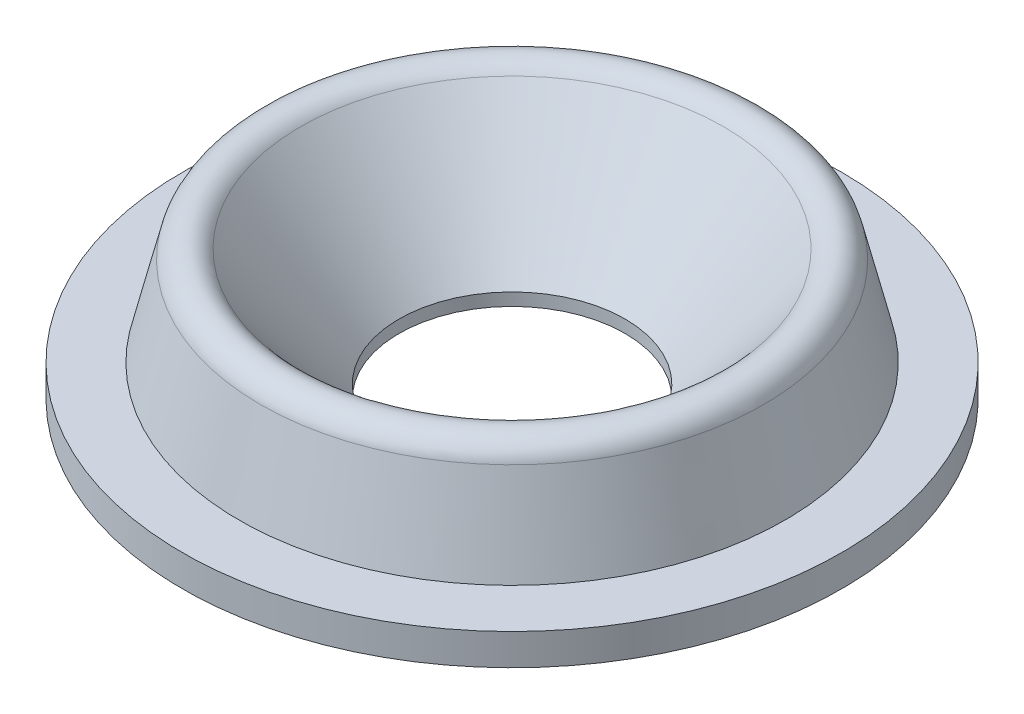
ISO-10303-21;
HEADER;
FILE_DESCRIPTION(('STEP AP214'),'2;1');
FILE_NAME('part.step','',(''),(''),'','','');
FILE_SCHEMA(('AUTOMOTIVE_DESIGN { 1 0 10303 214 1 1 1 1 }'));
ENDSEC;
DATA;
#1=APPLICATION_CONTEXT('core data for automotive mechanical design processes');
#2=APPLICATION_PROTOCOL_DEFINITION('international standard','automotive_design',2000,#1);
#3=PRODUCT_CONTEXT('',#1,'mechanical');
#4=PRODUCT('Part','Part','',(#3));
#5=PRODUCT_RELATED_PRODUCT_CATEGORY('part','',(#4));
#6=PRODUCT_DEFINITION_FORMATION('','',#4);
#7=PRODUCT_DEFINITION_CONTEXT('part definition',#1,'design');
#8=PRODUCT_DEFINITION('design','',#6,#7);
#9=PRODUCT_DEFINITION_SHAPE('','',#8);
#10=(LENGTH_UNIT() NAMED_UNIT(*) SI_UNIT(.MILLI.,.METRE.));
#11=(NAMED_UNIT(*) PLANE_ANGLE_UNIT() SI_UNIT($,.RADIAN.));
#12=(NAMED_UNIT(*) SI_UNIT($,.STERADIAN.) SOLID_ANGLE_UNIT());
#13=UNCERTAINTY_MEASURE_WITH_UNIT(LENGTH_MEASURE(1.E-05),#10,'distance_accuracy_value','');
#14=(GEOMETRIC_REPRESENTATION_CONTEXT(3) GLOBAL_UNCERTAINTY_ASSIGNED_CONTEXT((#13)) GLOBAL_UNIT_ASSIGNED_CONTEXT((#10,
#11,#12)) REPRESENTATION_CONTEXT('',''));
#15=CARTESIAN_POINT('',(0.,0.,0.));
#16=DIRECTION('',(0.,0.,1.));
#17=DIRECTION('',(1.,0.,0.));
#18=AXIS2_PLACEMENT_3D('',#15,#16,#17);
#19=CARTESIAN_POINT('',(-2.286,0.,0.));
#20=DIRECTION('',(0.,1.,0.));
#21=DIRECTION('',(0.,0.,1.));
#22=AXIS2_PLACEMENT_3D('',#19,#20,#21);
#23=PLANE('',#22);
#24=CARTESIAN_POINT('',(0.,0.,0.));
#25=DIRECTION('',(0.,1.,0.));
#26=DIRECTION('',(0.,0.,1.));
#27=AXIS2_PLACEMENT_3D('',#24,#25,#26);
#28=CIRCLE('',#27,4.86179339124413);
#29=CARTESIAN_POINT('',(0.,0.,4.86179339124413));
#30=VERTEX_POINT('',#29);
#31=EDGE_CURVE('E60',#30,#30,#28,.T.);
#32=ORIENTED_EDGE('',*,*,#31,.T.);
#33=EDGE_LOOP('',(#32));
#34=FACE_BOUND('',#33,.T.);
#35=CARTESIAN_POINT('',(0.,0.,0.));
#36=DIRECTION('',(0.,-1.,0.));
#37=DIRECTION('',(0.,0.,-1.));
#38=AXIS2_PLACEMENT_3D('',#35,#36,#37);
#39=CIRCLE('',#38,6.6675);
#40=CARTESIAN_POINT('',(0.,0.,-6.6675));
#41=VERTEX_POINT('',#40);
#42=EDGE_CURVE('E46',#41,#41,#39,.T.);
#43=ORIENTED_EDGE('',*,*,#42,.T.);
#44=EDGE_LOOP('',(#43));
#45=FACE_BOUND('',#44,.T.);
#46=ADVANCED_FACE('F31',(#34,#45),#23,.F.);
#47=CARTESIAN_POINT('',(0.,2.32833333333333,0.));
#48=DIRECTION('',(0.,-1.,0.));
#49=DIRECTION('',(0.,0.,-1.));
#50=AXIS2_PLACEMENT_3D('',#47,#48,#49);
#51=TOROIDAL_SURFACE('',#50,4.63445699600448,0.465666666666667);
#52=CARTESIAN_POINT('',(0.,2.43813522934981,0.));
#53=DIRECTION('',(0.,-1.,0.));
#54=DIRECTION('',(0.,0.,-1.));
#55=AXIS2_PLACEMENT_3D('',#52,#53,#54);
#56=CIRCLE('',#55,5.08699316922783);
#57=CARTESIAN_POINT('',(0.,2.43813522934981,-5.08699316922783));
#58=VERTEX_POINT('',#57);
#59=EDGE_CURVE('E57',#58,#58,#56,.T.);
#60=ORIENTED_EDGE('',*,*,#59,.F.);
#61=EDGE_LOOP('',(#60));
#62=FACE_BOUND('',#61,.T.);
#63=CARTESIAN_POINT('',(0.,2.6276580969107,0.));
#64=DIRECTION('',(0.,-1.,0.));
#65=DIRECTION('',(0.,0.,-1.));
#66=AXIS2_PLACEMENT_3D('',#63,#64,#65);
#67=CIRCLE('',#66,4.27773563365874);
#68=CARTESIAN_POINT('',(0.,2.6276580969107,-4.27773563365874));
#69=VERTEX_POINT('',#68);
#70=EDGE_CURVE('E10',#69,#69,#67,.T.);
#71=ORIENTED_EDGE('',*,*,#70,.T.);
#72=EDGE_LOOP('',(#71));
#73=FACE_BOUND('',#72,.T.);
#74=ADVANCED_FACE('F33',(#62,#73),#51,.T.);
#75=CARTESIAN_POINT('',(0.,0.253999999999999,0.));
#76=DIRECTION('',(0.,1.,0.));
#77=DIRECTION('',(0.,0.,1.));
#78=AXIS2_PLACEMENT_3D('',#75,#76,#77);
#79=CONICAL_SURFACE('',#78,2.286,0.698131700797734);
#80=ORIENTED_EDGE('',*,*,#70,.F.);
#81=EDGE_LOOP('',(#80));
#82=FACE_BOUND('',#81,.T.);
#83=CARTESIAN_POINT('',(0.,0.253999999999999,0.));
#84=DIRECTION('',(0.,-1.,0.));
#85=DIRECTION('',(0.,0.,-1.));
#86=AXIS2_PLACEMENT_3D('',#83,#84,#85);
#87=CIRCLE('',#86,2.286);
#88=CARTESIAN_POINT('',(0.,0.253999999999999,-2.286));
#89=VERTEX_POINT('',#88);
#90=EDGE_CURVE('E38',#89,#89,#87,.T.);
#91=ORIENTED_EDGE('',*,*,#90,.T.);
#92=EDGE_LOOP('',(#91));
#93=FACE_BOUND('',#92,.T.);
#94=ADVANCED_FACE('F104',(#82,#93),#79,.F.);
#95=CARTESIAN_POINT('',(0.,0.,0.));
#96=DIRECTION('',(0.,-1.,0.));
#97=DIRECTION('',(0.,0.,-1.));
#98=AXIS2_PLACEMENT_3D('',#95,#96,#97);
#99=CYLINDRICAL_SURFACE('',#98,2.286);
#100=ORIENTED_EDGE('',*,*,#90,.F.);
#101=EDGE_LOOP('',(#100));
#102=FACE_BOUND('',#101,.T.);
#103=CARTESIAN_POINT('',(0.,0.,0.));
#104=DIRECTION('',(0.,-1.,0.));
#105=DIRECTION('',(0.,0.,-1.));
#106=AXIS2_PLACEMENT_3D('',#103,#104,#105);
#107=CIRCLE('',#106,2.286);
#108=CARTESIAN_POINT('',(0.,0.,-2.286));
#109=VERTEX_POINT('',#108);
#110=EDGE_CURVE('E42',#109,#109,#107,.T.);
#111=ORIENTED_EDGE('',*,*,#110,.T.);
#112=EDGE_LOOP('',(#111));
#113=FACE_BOUND('',#112,.T.);
#114=ADVANCED_FACE('F108',(#102,#113),#99,.F.);
#115=CARTESIAN_POINT('',(0.,0.,0.));
#116=DIRECTION('',(0.,1.,0.));
#117=DIRECTION('',(0.,0.,1.));
#118=AXIS2_PLACEMENT_3D('',#115,#116,#117);
#119=CIRCLE('',#118,3.10903572958847);
#120=CARTESIAN_POINT('',(0.,0.,3.10903572958847));
#121=VERTEX_POINT('',#120);
#122=EDGE_CURVE('E63',#121,#121,#119,.F.);
#123=ORIENTED_EDGE('',*,*,#122,.T.);
#124=EDGE_LOOP('',(#123));
#125=FACE_BOUND('',#124,.T.);
#126=ORIENTED_EDGE('',*,*,#110,.F.);
#127=EDGE_LOOP('',(#126));
#128=FACE_BOUND('',#127,.T.);
#129=ADVANCED_FACE('F83',(#125,#128),#23,.F.);
#130=CARTESIAN_POINT('',(0.,0.,0.));
#131=DIRECTION('',(0.,-1.,0.));
#132=DIRECTION('',(0.,0.,-1.));
#133=AXIS2_PLACEMENT_3D('',#130,#131,#132);
#134=CYLINDRICAL_SURFACE('',#133,6.6675);
#135=ORIENTED_EDGE('',*,*,#42,.F.);
#136=EDGE_LOOP('',(#135));
#137=FACE_BOUND('',#136,.T.);
#138=CARTESIAN_POINT('',(0.,0.634999999999999,0.));
#139=DIRECTION('',(0.,-1.,0.));
#140=DIRECTION('',(0.,0.,-1.));
#141=AXIS2_PLACEMENT_3D('',#138,#139,#140);
#142=CIRCLE('',#141,6.6675);
#143=CARTESIAN_POINT('',(0.,0.634999999999999,-6.6675));
#144=VERTEX_POINT('',#143);
#145=EDGE_CURVE('E51',#144,#144,#142,.T.);
#146=ORIENTED_EDGE('',*,*,#145,.T.);
#147=EDGE_LOOP('',(#146));
#148=FACE_BOUND('',#147,.T.);
#149=ADVANCED_FACE('F86',(#137,#148),#134,.T.);
#150=CARTESIAN_POINT('',(-6.6675,0.634999999999999,0.));
#151=DIRECTION('',(0.,-1.,0.));
#152=DIRECTION('',(0.,0.,-1.));
#153=AXIS2_PLACEMENT_3D('',#150,#151,#152);
#154=PLANE('',#153);
#155=ORIENTED_EDGE('',*,*,#145,.F.);
#156=EDGE_LOOP('',(#155));
#157=FACE_BOUND('',#156,.T.);
#158=CARTESIAN_POINT('',(0.,0.634999999999999,0.));
#159=DIRECTION('',(0.,-1.,0.));
#160=DIRECTION('',(0.,0.,-1.));
#161=AXIS2_PLACEMENT_3D('',#158,#159,#160);
#162=CIRCLE('',#161,5.5245);
#163=CARTESIAN_POINT('',(0.,0.634999999999999,-5.5245));
#164=VERTEX_POINT('',#163);
#165=EDGE_CURVE('E54',#164,#164,#162,.T.);
#166=ORIENTED_EDGE('',*,*,#165,.T.);
#167=EDGE_LOOP('',(#166));
#168=FACE_BOUND('',#167,.T.);
#169=ADVANCED_FACE('F89',(#157,#168),#154,.F.);
#170=CARTESIAN_POINT('',(0.,2.43813522934981,0.));
#171=DIRECTION('',(0.,-1.,0.));
#172=DIRECTION('',(0.,0.,-1.));
#173=AXIS2_PLACEMENT_3D('',#170,#171,#172);
#174=CONICAL_SURFACE('',#173,5.08699316922783,0.238036608007879);
#175=ORIENTED_EDGE('',*,*,#165,.F.);
#176=EDGE_LOOP('',(#175));
#177=FACE_BOUND('',#176,.T.);
#178=ORIENTED_EDGE('',*,*,#59,.T.);
#179=EDGE_LOOP('',(#178));
#180=FACE_BOUND('',#179,.T.);
#181=ADVANCED_FACE('F76',(#177,#180),#174,.T.);
#182=CARTESIAN_POINT('',(0.,2.25097290659445,0.));
#183=DIRECTION('',(0.,-1.,0.));
#184=DIRECTION('',(0.,0.,-1.));
#185=AXIS2_PLACEMENT_3D('',#182,#183,#184);
#186=CONICAL_SURFACE('',#185,4.31562469214257,0.238036608007879);
#187=CARTESIAN_POINT('',(0.,1.62031871080276,0.));
#188=DIRECTION('',(0.,1.,0.));
#189=DIRECTION('',(0.,0.,1.));
#190=AXIS2_PLACEMENT_3D('',#187,#188,#189);
#191=CIRCLE('',#190,4.46864456221271);
#192=CARTESIAN_POINT('',(0.,1.62031871080276,4.46864456221271));
#193=VERTEX_POINT('',#192);
#194=EDGE_CURVE('E66',#193,#193,#191,.F.);
#195=ORIENTED_EDGE('',*,*,#194,.F.);
#196=EDGE_LOOP('',(#195));
#197=FACE_BOUND('',#196,.T.);
#198=ORIENTED_EDGE('',*,*,#31,.F.);
#199=EDGE_LOOP('',(#198));
#200=FACE_BOUND('',#199,.T.);
#201=ADVANCED_FACE('F73',(#197,#200),#186,.F.);
#202=CARTESIAN_POINT('',(0.,-0.256212665188693,0.));
#203=DIRECTION('',(0.,1.,0.));
#204=DIRECTION('',(0.,0.,1.));
#205=AXIS2_PLACEMENT_3D('',#202,#203,#204);
#206=CONICAL_SURFACE('',#205,2.89404777672569,0.698131700797734);
#207=ORIENTED_EDGE('',*,*,#194,.T.);
#208=EDGE_LOOP('',(#207));
#209=FACE_BOUND('',#208,.T.);
#210=ORIENTED_EDGE('',*,*,#122,.F.);
#211=EDGE_LOOP('',(#210));
#212=FACE_BOUND('',#211,.T.);
#213=ADVANCED_FACE('F70',(#209,#212),#206,.T.);
#214=CLOSED_SHELL('',(#46,#74,#94,#114,#129,#149,#169,#181,#201,#213));
#215=MANIFOLD_SOLID_BREP('B2',#214);
#216=ADVANCED_BREP_SHAPE_REPRESENTATION('',(#18,#215),#14);
#217=SHAPE_DEFINITION_REPRESENTATION(#9,#216);
ENDSEC;
END-ISO-10303-21;
